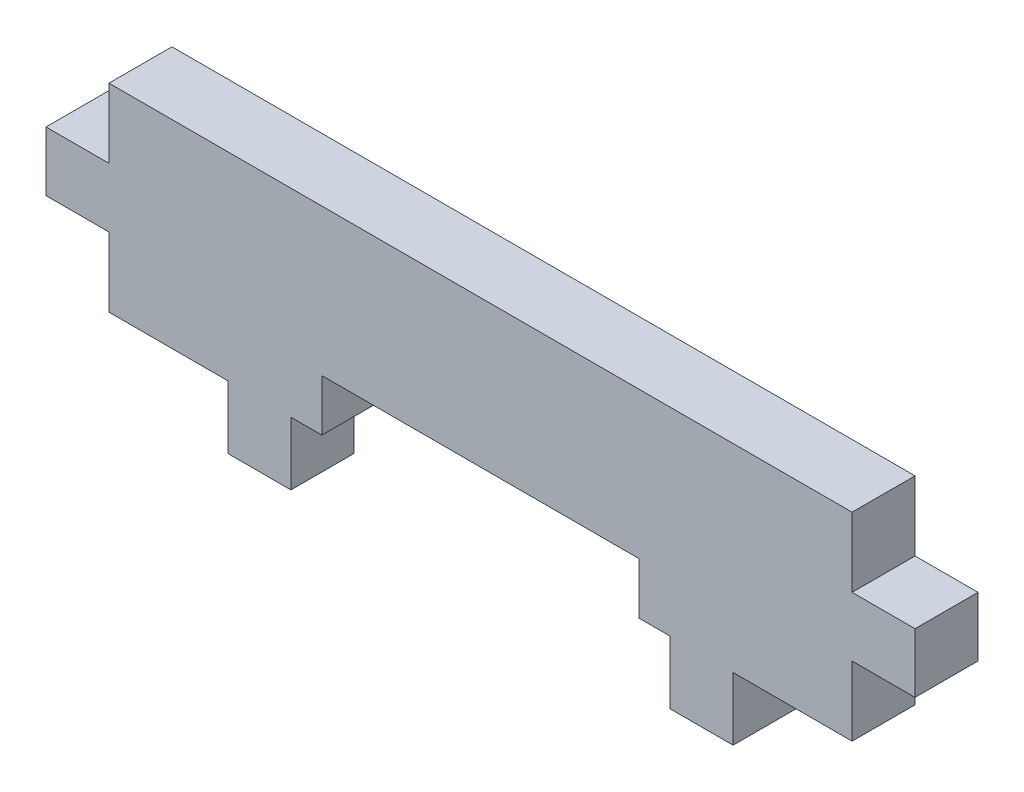
ISO-10303-21;
HEADER;
FILE_DESCRIPTION(('STEP AP214'),'2;1');
FILE_NAME('part.step','',(''),(''),'','','');
FILE_SCHEMA(('AUTOMOTIVE_DESIGN { 1 0 10303 214 1 1 1 1 }'));
ENDSEC;
DATA;
#1=APPLICATION_CONTEXT('core data for automotive mechanical design processes');
#2=APPLICATION_PROTOCOL_DEFINITION('international standard','automotive_design',2000,#1);
#3=PRODUCT_CONTEXT('',#1,'mechanical');
#4=PRODUCT('Part','Part','',(#3));
#5=PRODUCT_RELATED_PRODUCT_CATEGORY('part','',(#4));
#6=PRODUCT_DEFINITION_FORMATION('','',#4);
#7=PRODUCT_DEFINITION_CONTEXT('part definition',#1,'design');
#8=PRODUCT_DEFINITION('design','',#6,#7);
#9=PRODUCT_DEFINITION_SHAPE('','',#8);
#10=(LENGTH_UNIT() NAMED_UNIT(*) SI_UNIT(.MILLI.,.METRE.));
#11=(NAMED_UNIT(*) PLANE_ANGLE_UNIT() SI_UNIT($,.RADIAN.));
#12=(NAMED_UNIT(*) SI_UNIT($,.STERADIAN.) SOLID_ANGLE_UNIT());
#13=UNCERTAINTY_MEASURE_WITH_UNIT(LENGTH_MEASURE(1.E-05),#10,'distance_accuracy_value','');
#14=(GEOMETRIC_REPRESENTATION_CONTEXT(3) GLOBAL_UNCERTAINTY_ASSIGNED_CONTEXT((#13)) GLOBAL_UNIT_ASSIGNED_CONTEXT((#10,
#11,#12)) REPRESENTATION_CONTEXT('',''));
#15=CARTESIAN_POINT('',(0.,0.,0.));
#16=DIRECTION('',(0.,0.,1.));
#17=DIRECTION('',(1.,0.,0.));
#18=AXIS2_PLACEMENT_3D('',#15,#16,#17);
#19=CARTESIAN_POINT('',(9.56000000000001,-14.3526159152148,-3.175));
#20=DIRECTION('',(-1.,0.,0.));
#21=DIRECTION('',(0.,0.,1.));
#22=AXIS2_PLACEMENT_3D('',#19,#20,#21);
#23=PLANE('',#22);
#24=DIRECTION('',(0.,-1.,0.));
#25=VECTOR('',#24,1.);
#26=CARTESIAN_POINT('',(9.56000000000001,-14.3526159152148,0.));
#27=LINE('',#26,#25);
#28=CARTESIAN_POINT('',(9.56000000000001,-11.1776159152148,0.));
#29=VERTEX_POINT('',#28);
#30=CARTESIAN_POINT('',(9.56000000000001,-14.3526159152148,0.));
#31=VERTEX_POINT('',#30);
#32=EDGE_CURVE('E225',#29,#31,#27,.T.);
#33=ORIENTED_EDGE('',*,*,#32,.F.);
#34=DIRECTION('',(0.,0.,1.));
#35=VECTOR('',#34,1.);
#36=CARTESIAN_POINT('',(9.56000000000001,-11.1776159152148,-3.175));
#37=LINE('',#36,#35);
#38=CARTESIAN_POINT('',(9.56000000000001,-11.1776159152148,-3.175));
#39=VERTEX_POINT('',#38);
#40=EDGE_CURVE('E11',#39,#29,#37,.T.);
#41=ORIENTED_EDGE('',*,*,#40,.F.);
#42=DIRECTION('',(0.,-1.,0.));
#43=VECTOR('',#42,1.);
#44=CARTESIAN_POINT('',(9.56000000000001,-14.3526159152148,-3.175));
#45=LINE('',#44,#43);
#46=CARTESIAN_POINT('',(9.56000000000001,-14.3526159152148,-3.175));
#47=VERTEX_POINT('',#46);
#48=EDGE_CURVE('E293',#39,#47,#45,.T.);
#49=ORIENTED_EDGE('',*,*,#48,.T.);
#50=DIRECTION('',(0.,0.,1.));
#51=VECTOR('',#50,1.);
#52=CARTESIAN_POINT('',(9.56000000000001,-14.3526159152148,-3.175));
#53=LINE('',#52,#51);
#54=EDGE_CURVE('E35',#47,#31,#53,.T.);
#55=ORIENTED_EDGE('',*,*,#54,.T.);
#56=EDGE_LOOP('',(#33,#41,#49,#55));
#57=FACE_BOUND('',#56,.T.);
#58=ADVANCED_FACE('F32',(#57),#23,.T.);
#59=CARTESIAN_POINT('',(9.56000000000001,-11.1776159152148,-3.175));
#60=DIRECTION('',(0.,-1.,0.));
#61=DIRECTION('',(0.,0.,-1.));
#62=AXIS2_PLACEMENT_3D('',#59,#60,#61);
#63=PLANE('',#62);
#64=DIRECTION('',(1.,0.,0.));
#65=VECTOR('',#64,1.);
#66=CARTESIAN_POINT('',(9.56000000000001,-11.1776159152148,0.));
#67=LINE('',#66,#65);
#68=CARTESIAN_POINT('',(8.,-11.1776159152148,0.));
#69=VERTEX_POINT('',#68);
#70=EDGE_CURVE('E291',#69,#29,#67,.T.);
#71=ORIENTED_EDGE('',*,*,#70,.F.);
#72=DIRECTION('',(0.,0.,1.));
#73=VECTOR('',#72,1.);
#74=CARTESIAN_POINT('',(8.,-11.1776159152148,-3.175));
#75=LINE('',#74,#73);
#76=CARTESIAN_POINT('',(8.,-11.1776159152148,-3.175));
#77=VERTEX_POINT('',#76);
#78=EDGE_CURVE('E41',#77,#69,#75,.T.);
#79=ORIENTED_EDGE('',*,*,#78,.F.);
#80=DIRECTION('',(1.,0.,0.));
#81=VECTOR('',#80,1.);
#82=CARTESIAN_POINT('',(9.56000000000001,-11.1776159152148,-3.175));
#83=LINE('',#82,#81);
#84=EDGE_CURVE('E215',#77,#39,#83,.T.);
#85=ORIENTED_EDGE('',*,*,#84,.T.);
#86=ORIENTED_EDGE('',*,*,#40,.T.);
#87=EDGE_LOOP('',(#71,#79,#85,#86));
#88=FACE_BOUND('',#87,.T.);
#89=ADVANCED_FACE('F337',(#88),#63,.T.);
#90=CARTESIAN_POINT('',(8.,-8.57761591521484,-3.175));
#91=DIRECTION('',(-1.,0.,0.));
#92=DIRECTION('',(0.,0.,1.));
#93=AXIS2_PLACEMENT_3D('',#90,#91,#92);
#94=PLANE('',#93);
#95=DIRECTION('',(0.,-1.,0.));
#96=VECTOR('',#95,1.);
#97=CARTESIAN_POINT('',(8.,-8.57761591521484,0.));
#98=LINE('',#97,#96);
#99=CARTESIAN_POINT('',(8.,-8.57761591521484,0.));
#100=VERTEX_POINT('',#99);
#101=EDGE_CURVE('E202',#100,#69,#98,.T.);
#102=ORIENTED_EDGE('',*,*,#101,.F.);
#103=DIRECTION('',(0.,0.,1.));
#104=VECTOR('',#103,1.);
#105=CARTESIAN_POINT('',(8.,-8.57761591521484,-3.175));
#106=LINE('',#105,#104);
#107=CARTESIAN_POINT('',(8.,-8.57761591521484,-3.175));
#108=VERTEX_POINT('',#107);
#109=EDGE_CURVE('E197',#108,#100,#106,.T.);
#110=ORIENTED_EDGE('',*,*,#109,.F.);
#111=DIRECTION('',(0.,-1.,0.));
#112=VECTOR('',#111,1.);
#113=CARTESIAN_POINT('',(8.,-8.57761591521484,-3.175));
#114=LINE('',#113,#112);
#115=EDGE_CURVE('E200',#108,#77,#114,.T.);
#116=ORIENTED_EDGE('',*,*,#115,.T.);
#117=ORIENTED_EDGE('',*,*,#78,.T.);
#118=EDGE_LOOP('',(#102,#110,#116,#117));
#119=FACE_BOUND('',#118,.T.);
#120=ADVANCED_FACE('F199',(#119),#94,.T.);
#121=CARTESIAN_POINT('',(-8.,-8.57761591521484,-3.175));
#122=DIRECTION('',(0.,-1.,0.));
#123=DIRECTION('',(1.,0.,0.));
#124=AXIS2_PLACEMENT_3D('',#121,#122,#123);
#125=PLANE('',#124);
#126=DIRECTION('',(1.,0.,0.));
#127=VECTOR('',#126,1.);
#128=CARTESIAN_POINT('',(-8.,-8.57761591521484,0.));
#129=LINE('',#128,#127);
#130=CARTESIAN_POINT('',(-8.,-8.57761591521484,0.));
#131=VERTEX_POINT('',#130);
#132=EDGE_CURVE('E288',#131,#100,#129,.T.);
#133=ORIENTED_EDGE('',*,*,#132,.F.);
#134=DIRECTION('',(0.,0.,1.));
#135=VECTOR('',#134,1.);
#136=CARTESIAN_POINT('',(-8.,-8.57761591521484,-3.175));
#137=LINE('',#136,#135);
#138=CARTESIAN_POINT('',(-8.,-8.57761591521484,-3.175));
#139=VERTEX_POINT('',#138);
#140=EDGE_CURVE('E207',#139,#131,#137,.T.);
#141=ORIENTED_EDGE('',*,*,#140,.F.);
#142=DIRECTION('',(1.,0.,0.));
#143=VECTOR('',#142,1.);
#144=CARTESIAN_POINT('',(-8.,-8.57761591521484,-3.175));
#145=LINE('',#144,#143);
#146=EDGE_CURVE('E213',#139,#108,#145,.T.);
#147=ORIENTED_EDGE('',*,*,#146,.T.);
#148=ORIENTED_EDGE('',*,*,#109,.T.);
#149=EDGE_LOOP('',(#133,#141,#147,#148));
#150=FACE_BOUND('',#149,.T.);
#151=ADVANCED_FACE('F217',(#150),#125,.T.);
#152=CARTESIAN_POINT('',(-8.,-8.57761591521484,-3.175));
#153=DIRECTION('',(1.,0.,0.));
#154=DIRECTION('',(0.,0.,-1.));
#155=AXIS2_PLACEMENT_3D('',#152,#153,#154);
#156=PLANE('',#155);
#157=DIRECTION('',(0.,1.,0.));
#158=VECTOR('',#157,1.);
#159=CARTESIAN_POINT('',(-8.,-8.57761591521484,0.));
#160=LINE('',#159,#158);
#161=CARTESIAN_POINT('',(-8.,-11.1776159152148,0.));
#162=VERTEX_POINT('',#161);
#163=EDGE_CURVE('E285',#162,#131,#160,.T.);
#164=ORIENTED_EDGE('',*,*,#163,.F.);
#165=DIRECTION('',(0.,0.,1.));
#166=VECTOR('',#165,1.);
#167=CARTESIAN_POINT('',(-8.,-11.1776159152148,-3.175));
#168=LINE('',#167,#166);
#169=CARTESIAN_POINT('',(-8.,-11.1776159152148,-3.175));
#170=VERTEX_POINT('',#169);
#171=EDGE_CURVE('E297',#170,#162,#168,.T.);
#172=ORIENTED_EDGE('',*,*,#171,.F.);
#173=DIRECTION('',(0.,1.,0.));
#174=VECTOR('',#173,1.);
#175=CARTESIAN_POINT('',(-8.,-8.57761591521484,-3.175));
#176=LINE('',#175,#174);
#177=EDGE_CURVE('E218',#170,#139,#176,.T.);
#178=ORIENTED_EDGE('',*,*,#177,.T.);
#179=ORIENTED_EDGE('',*,*,#140,.T.);
#180=EDGE_LOOP('',(#164,#172,#178,#179));
#181=FACE_BOUND('',#180,.T.);
#182=ADVANCED_FACE('F350',(#181),#156,.T.);
#183=CARTESIAN_POINT('',(-9.56000000000001,-11.1776159152148,-3.175));
#184=DIRECTION('',(0.,-1.,0.));
#185=DIRECTION('',(0.,0.,-1.));
#186=AXIS2_PLACEMENT_3D('',#183,#184,#185);
#187=PLANE('',#186);
#188=DIRECTION('',(1.,0.,0.));
#189=VECTOR('',#188,1.);
#190=CARTESIAN_POINT('',(-9.56000000000001,-11.1776159152148,0.));
#191=LINE('',#190,#189);
#192=CARTESIAN_POINT('',(-9.56000000000001,-11.1776159152148,0.));
#193=VERTEX_POINT('',#192);
#194=EDGE_CURVE('E282',#193,#162,#191,.T.);
#195=ORIENTED_EDGE('',*,*,#194,.F.);
#196=DIRECTION('',(0.,0.,1.));
#197=VECTOR('',#196,1.);
#198=CARTESIAN_POINT('',(-9.56000000000001,-11.1776159152148,-3.175));
#199=LINE('',#198,#197);
#200=CARTESIAN_POINT('',(-9.56000000000001,-11.1776159152148,-3.175));
#201=VERTEX_POINT('',#200);
#202=EDGE_CURVE('E299',#201,#193,#199,.T.);
#203=ORIENTED_EDGE('',*,*,#202,.F.);
#204=DIRECTION('',(1.,0.,0.));
#205=VECTOR('',#204,1.);
#206=CARTESIAN_POINT('',(-9.56000000000001,-11.1776159152148,-3.175));
#207=LINE('',#206,#205);
#208=EDGE_CURVE('E220',#201,#170,#207,.T.);
#209=ORIENTED_EDGE('',*,*,#208,.T.);
#210=ORIENTED_EDGE('',*,*,#171,.T.);
#211=EDGE_LOOP('',(#195,#203,#209,#210));
#212=FACE_BOUND('',#211,.T.);
#213=ADVANCED_FACE('F353',(#212),#187,.T.);
#214=CARTESIAN_POINT('',(-9.56000000000001,-14.3526159152148,-3.175));
#215=DIRECTION('',(1.,0.,0.));
#216=DIRECTION('',(0.,0.,-1.));
#217=AXIS2_PLACEMENT_3D('',#214,#215,#216);
#218=PLANE('',#217);
#219=DIRECTION('',(0.,1.,0.));
#220=VECTOR('',#219,1.);
#221=CARTESIAN_POINT('',(-9.56000000000001,-14.3526159152148,0.));
#222=LINE('',#221,#220);
#223=CARTESIAN_POINT('',(-9.56000000000001,-14.3526159152148,0.));
#224=VERTEX_POINT('',#223);
#225=EDGE_CURVE('E279',#224,#193,#222,.T.);
#226=ORIENTED_EDGE('',*,*,#225,.F.);
#227=DIRECTION('',(0.,0.,1.));
#228=VECTOR('',#227,1.);
#229=CARTESIAN_POINT('',(-9.56000000000001,-14.3526159152148,-3.175));
#230=LINE('',#229,#228);
#231=CARTESIAN_POINT('',(-9.56000000000001,-14.3526159152148,-3.175));
#232=VERTEX_POINT('',#231);
#233=EDGE_CURVE('E301',#232,#224,#230,.T.);
#234=ORIENTED_EDGE('',*,*,#233,.F.);
#235=DIRECTION('',(0.,1.,0.));
#236=VECTOR('',#235,1.);
#237=CARTESIAN_POINT('',(-9.56000000000001,-14.3526159152148,-3.175));
#238=LINE('',#237,#236);
#239=EDGE_CURVE('E643',#232,#201,#238,.T.);
#240=ORIENTED_EDGE('',*,*,#239,.T.);
#241=ORIENTED_EDGE('',*,*,#202,.T.);
#242=EDGE_LOOP('',(#226,#234,#240,#241));
#243=FACE_BOUND('',#242,.T.);
#244=ADVANCED_FACE('F357',(#243),#218,.T.);
#245=CARTESIAN_POINT('',(-12.735,-14.3526159152148,-3.175));
#246=DIRECTION('',(0.,-1.,0.));
#247=DIRECTION('',(0.,0.,-1.));
#248=AXIS2_PLACEMENT_3D('',#245,#246,#247);
#249=PLANE('',#248);
#250=DIRECTION('',(1.,0.,0.));
#251=VECTOR('',#250,1.);
#252=CARTESIAN_POINT('',(-12.735,-14.3526159152148,0.));
#253=LINE('',#252,#251);
#254=CARTESIAN_POINT('',(-12.735,-14.3526159152148,0.));
#255=VERTEX_POINT('',#254);
#256=EDGE_CURVE('E276',#255,#224,#253,.T.);
#257=ORIENTED_EDGE('',*,*,#256,.F.);
#258=DIRECTION('',(0.,0.,1.));
#259=VECTOR('',#258,1.);
#260=CARTESIAN_POINT('',(-12.735,-14.3526159152148,-3.175));
#261=LINE('',#260,#259);
#262=CARTESIAN_POINT('',(-12.735,-14.3526159152148,-3.175));
#263=VERTEX_POINT('',#262);
#264=EDGE_CURVE('E303',#263,#255,#261,.T.);
#265=ORIENTED_EDGE('',*,*,#264,.F.);
#266=DIRECTION('',(1.,0.,0.));
#267=VECTOR('',#266,1.);
#268=CARTESIAN_POINT('',(-12.735,-14.3526159152148,-3.175));
#269=LINE('',#268,#267);
#270=EDGE_CURVE('E647',#263,#232,#269,.T.);
#271=ORIENTED_EDGE('',*,*,#270,.T.);
#272=ORIENTED_EDGE('',*,*,#233,.T.);
#273=EDGE_LOOP('',(#257,#265,#271,#272));
#274=FACE_BOUND('',#273,.T.);
#275=ADVANCED_FACE('F361',(#274),#249,.T.);
#276=CARTESIAN_POINT('',(-12.735,-11.1776159152148,-3.175));
#277=DIRECTION('',(-1.,0.,0.));
#278=DIRECTION('',(0.,0.,1.));
#279=AXIS2_PLACEMENT_3D('',#276,#277,#278);
#280=PLANE('',#279);
#281=DIRECTION('',(0.,-1.,0.));
#282=VECTOR('',#281,1.);
#283=CARTESIAN_POINT('',(-12.735,-11.1776159152148,0.));
#284=LINE('',#283,#282);
#285=CARTESIAN_POINT('',(-12.735,-11.1776159152148,0.));
#286=VERTEX_POINT('',#285);
#287=EDGE_CURVE('E273',#286,#255,#284,.T.);
#288=ORIENTED_EDGE('',*,*,#287,.F.);
#289=DIRECTION('',(0.,0.,1.));
#290=VECTOR('',#289,1.);
#291=CARTESIAN_POINT('',(-12.735,-11.1776159152148,-3.175));
#292=LINE('',#291,#290);
#293=CARTESIAN_POINT('',(-12.735,-11.1776159152148,-3.175));
#294=VERTEX_POINT('',#293);
#295=EDGE_CURVE('E305',#294,#286,#292,.T.);
#296=ORIENTED_EDGE('',*,*,#295,.F.);
#297=DIRECTION('',(0.,-1.,0.));
#298=VECTOR('',#297,1.);
#299=CARTESIAN_POINT('',(-12.735,-11.1776159152148,-3.175));
#300=LINE('',#299,#298);
#301=EDGE_CURVE('E636',#294,#263,#300,.T.);
#302=ORIENTED_EDGE('',*,*,#301,.T.);
#303=ORIENTED_EDGE('',*,*,#264,.T.);
#304=EDGE_LOOP('',(#288,#296,#302,#303));
#305=FACE_BOUND('',#304,.T.);
#306=ADVANCED_FACE('F365',(#305),#280,.T.);
#307=CARTESIAN_POINT('',(-12.735,-11.1776159152148,-3.175));
#308=DIRECTION('',(0.,-1.,0.));
#309=DIRECTION('',(0.,0.,-1.));
#310=AXIS2_PLACEMENT_3D('',#307,#308,#309);
#311=PLANE('',#310);
#312=DIRECTION('',(1.,0.,0.));
#313=VECTOR('',#312,1.);
#314=CARTESIAN_POINT('',(-12.735,-11.1776159152148,0.));
#315=LINE('',#314,#313);
#316=CARTESIAN_POINT('',(-18.735,-11.1776159152148,0.));
#317=VERTEX_POINT('',#316);
#318=EDGE_CURVE('E270',#317,#286,#315,.T.);
#319=ORIENTED_EDGE('',*,*,#318,.F.);
#320=DIRECTION('',(0.,0.,1.));
#321=VECTOR('',#320,1.);
#322=CARTESIAN_POINT('',(-18.735,-11.1776159152148,-3.175));
#323=LINE('',#322,#321);
#324=CARTESIAN_POINT('',(-18.735,-11.1776159152148,-3.175));
#325=VERTEX_POINT('',#324);
#326=EDGE_CURVE('E307',#325,#317,#323,.T.);
#327=ORIENTED_EDGE('',*,*,#326,.F.);
#328=DIRECTION('',(1.,0.,0.));
#329=VECTOR('',#328,1.);
#330=CARTESIAN_POINT('',(-12.735,-11.1776159152148,-3.175));
#331=LINE('',#330,#329);
#332=EDGE_CURVE('E632',#325,#294,#331,.T.);
#333=ORIENTED_EDGE('',*,*,#332,.T.);
#334=ORIENTED_EDGE('',*,*,#295,.T.);
#335=EDGE_LOOP('',(#319,#327,#333,#334));
#336=FACE_BOUND('',#335,.T.);
#337=ADVANCED_FACE('F369',(#336),#311,.T.);
#338=CARTESIAN_POINT('',(-18.735,-11.1776159152148,-3.175));
#339=DIRECTION('',(-1.,0.,0.));
#340=DIRECTION('',(0.,0.,1.));
#341=AXIS2_PLACEMENT_3D('',#338,#339,#340);
#342=PLANE('',#341);
#343=DIRECTION('',(0.,-1.,0.));
#344=VECTOR('',#343,1.);
#345=CARTESIAN_POINT('',(-18.735,-11.1776159152148,0.));
#346=LINE('',#345,#344);
#347=CARTESIAN_POINT('',(-18.735,-7.67761591521484,0.));
#348=VERTEX_POINT('',#347);
#349=EDGE_CURVE('E267',#348,#317,#346,.T.);
#350=ORIENTED_EDGE('',*,*,#349,.F.);
#351=DIRECTION('',(0.,0.,1.));
#352=VECTOR('',#351,1.);
#353=CARTESIAN_POINT('',(-18.735,-7.67761591521484,-3.175));
#354=LINE('',#353,#352);
#355=CARTESIAN_POINT('',(-18.735,-7.67761591521484,-3.175));
#356=VERTEX_POINT('',#355);
#357=EDGE_CURVE('E309',#356,#348,#354,.T.);
#358=ORIENTED_EDGE('',*,*,#357,.F.);
#359=DIRECTION('',(0.,-1.,0.));
#360=VECTOR('',#359,1.);
#361=CARTESIAN_POINT('',(-18.735,-11.1776159152148,-3.175));
#362=LINE('',#361,#360);
#363=EDGE_CURVE('E653',#356,#325,#362,.T.);
#364=ORIENTED_EDGE('',*,*,#363,.T.);
#365=ORIENTED_EDGE('',*,*,#326,.T.);
#366=EDGE_LOOP('',(#350,#358,#364,#365));
#367=FACE_BOUND('',#366,.T.);
#368=ADVANCED_FACE('F373',(#367),#342,.T.);
#369=CARTESIAN_POINT('',(-18.735,-7.67761591521484,-3.175));
#370=DIRECTION('',(0.,-1.,0.));
#371=DIRECTION('',(1.,0.,0.));
#372=AXIS2_PLACEMENT_3D('',#369,#370,#371);
#373=PLANE('',#372);
#374=DIRECTION('',(1.,0.,0.));
#375=VECTOR('',#374,1.);
#376=CARTESIAN_POINT('',(-18.735,-7.67761591521484,0.));
#377=LINE('',#376,#375);
#378=CARTESIAN_POINT('',(-21.91,-7.67761591521484,0.));
#379=VERTEX_POINT('',#378);
#380=EDGE_CURVE('E264',#379,#348,#377,.T.);
#381=ORIENTED_EDGE('',*,*,#380,.F.);
#382=DIRECTION('',(0.,0.,1.));
#383=VECTOR('',#382,1.);
#384=CARTESIAN_POINT('',(-21.91,-7.67761591521484,-3.175));
#385=LINE('',#384,#383);
#386=CARTESIAN_POINT('',(-21.91,-7.67761591521484,-3.175));
#387=VERTEX_POINT('',#386);
#388=EDGE_CURVE('E311',#387,#379,#385,.T.);
#389=ORIENTED_EDGE('',*,*,#388,.F.);
#390=DIRECTION('',(1.,0.,0.));
#391=VECTOR('',#390,1.);
#392=CARTESIAN_POINT('',(-18.735,-7.67761591521484,-3.175));
#393=LINE('',#392,#391);
#394=EDGE_CURVE('E625',#387,#356,#393,.T.);
#395=ORIENTED_EDGE('',*,*,#394,.T.);
#396=ORIENTED_EDGE('',*,*,#357,.T.);
#397=EDGE_LOOP('',(#381,#389,#395,#396));
#398=FACE_BOUND('',#397,.T.);
#399=ADVANCED_FACE('F377',(#398),#373,.T.);
#400=CARTESIAN_POINT('',(-21.91,-4.67761591521484,-3.175));
#401=DIRECTION('',(-1.,0.,0.));
#402=DIRECTION('',(0.,0.,1.));
#403=AXIS2_PLACEMENT_3D('',#400,#401,#402);
#404=PLANE('',#403);
#405=DIRECTION('',(0.,-1.,0.));
#406=VECTOR('',#405,1.);
#407=CARTESIAN_POINT('',(-21.91,-4.67761591521484,0.));
#408=LINE('',#407,#406);
#409=CARTESIAN_POINT('',(-21.91,-4.67761591521484,0.));
#410=VERTEX_POINT('',#409);
#411=EDGE_CURVE('E261',#410,#379,#408,.T.);
#412=ORIENTED_EDGE('',*,*,#411,.F.);
#413=DIRECTION('',(0.,0.,1.));
#414=VECTOR('',#413,1.);
#415=CARTESIAN_POINT('',(-21.91,-4.67761591521484,-3.175));
#416=LINE('',#415,#414);
#417=CARTESIAN_POINT('',(-21.91,-4.67761591521484,-3.175));
#418=VERTEX_POINT('',#417);
#419=EDGE_CURVE('E313',#418,#410,#416,.T.);
#420=ORIENTED_EDGE('',*,*,#419,.F.);
#421=DIRECTION('',(0.,-1.,0.));
#422=VECTOR('',#421,1.);
#423=CARTESIAN_POINT('',(-21.91,-4.67761591521484,-3.175));
#424=LINE('',#423,#422);
#425=EDGE_CURVE('E621',#418,#387,#424,.T.);
#426=ORIENTED_EDGE('',*,*,#425,.T.);
#427=ORIENTED_EDGE('',*,*,#388,.T.);
#428=EDGE_LOOP('',(#412,#420,#426,#427));
#429=FACE_BOUND('',#428,.T.);
#430=ADVANCED_FACE('F381',(#429),#404,.T.);
#431=CARTESIAN_POINT('',(-21.91,-4.67761591521484,-3.175));
#432=DIRECTION('',(0.,1.,0.));
#433=DIRECTION('',(-1.,0.,0.));
#434=AXIS2_PLACEMENT_3D('',#431,#432,#433);
#435=PLANE('',#434);
#436=DIRECTION('',(-1.,0.,0.));
#437=VECTOR('',#436,1.);
#438=CARTESIAN_POINT('',(-21.91,-4.67761591521484,0.));
#439=LINE('',#438,#437);
#440=CARTESIAN_POINT('',(-18.735,-4.67761591521484,0.));
#441=VERTEX_POINT('',#440);
#442=EDGE_CURVE('E258',#441,#410,#439,.T.);
#443=ORIENTED_EDGE('',*,*,#442,.F.);
#444=DIRECTION('',(0.,0.,1.));
#445=VECTOR('',#444,1.);
#446=CARTESIAN_POINT('',(-18.735,-4.67761591521484,-3.175));
#447=LINE('',#446,#445);
#448=CARTESIAN_POINT('',(-18.735,-4.67761591521484,-3.175));
#449=VERTEX_POINT('',#448);
#450=EDGE_CURVE('E315',#449,#441,#447,.T.);
#451=ORIENTED_EDGE('',*,*,#450,.F.);
#452=DIRECTION('',(-1.,0.,0.));
#453=VECTOR('',#452,1.);
#454=CARTESIAN_POINT('',(-21.91,-4.67761591521484,-3.175));
#455=LINE('',#454,#453);
#456=EDGE_CURVE('E657',#449,#418,#455,.T.);
#457=ORIENTED_EDGE('',*,*,#456,.T.);
#458=ORIENTED_EDGE('',*,*,#419,.T.);
#459=EDGE_LOOP('',(#443,#451,#457,#458));
#460=FACE_BOUND('',#459,.T.);
#461=ADVANCED_FACE('F385',(#460),#435,.T.);
#462=CARTESIAN_POINT('',(-18.735,-4.67761591521484,-3.175));
#463=DIRECTION('',(-1.,0.,0.));
#464=DIRECTION('',(0.,0.,1.));
#465=AXIS2_PLACEMENT_3D('',#462,#463,#464);
#466=PLANE('',#465);
#467=DIRECTION('',(0.,-1.,0.));
#468=VECTOR('',#467,1.);
#469=CARTESIAN_POINT('',(-18.735,-4.67761591521484,0.));
#470=LINE('',#469,#468);
#471=CARTESIAN_POINT('',(-18.735,-1.17761591521484,0.));
#472=VERTEX_POINT('',#471);
#473=EDGE_CURVE('E255',#472,#441,#470,.T.);
#474=ORIENTED_EDGE('',*,*,#473,.F.);
#475=DIRECTION('',(0.,0.,1.));
#476=VECTOR('',#475,1.);
#477=CARTESIAN_POINT('',(-18.735,-1.17761591521484,-3.175));
#478=LINE('',#477,#476);
#479=CARTESIAN_POINT('',(-18.735,-1.17761591521484,-3.175));
#480=VERTEX_POINT('',#479);
#481=EDGE_CURVE('E317',#480,#472,#478,.T.);
#482=ORIENTED_EDGE('',*,*,#481,.F.);
#483=DIRECTION('',(0.,-1.,0.));
#484=VECTOR('',#483,1.);
#485=CARTESIAN_POINT('',(-18.735,-4.67761591521484,-3.175));
#486=LINE('',#485,#484);
#487=EDGE_CURVE('E614',#480,#449,#486,.T.);
#488=ORIENTED_EDGE('',*,*,#487,.T.);
#489=ORIENTED_EDGE('',*,*,#450,.T.);
#490=EDGE_LOOP('',(#474,#482,#488,#489));
#491=FACE_BOUND('',#490,.T.);
#492=ADVANCED_FACE('F389',(#491),#466,.T.);
#493=CARTESIAN_POINT('',(18.735,-1.17761591521484,-3.175));
#494=DIRECTION('',(0.,1.,0.));
#495=DIRECTION('',(0.,0.,1.));
#496=AXIS2_PLACEMENT_3D('',#493,#494,#495);
#497=PLANE('',#496);
#498=DIRECTION('',(-1.,0.,0.));
#499=VECTOR('',#498,1.);
#500=CARTESIAN_POINT('',(18.735,-1.17761591521484,0.));
#501=LINE('',#500,#499);
#502=CARTESIAN_POINT('',(18.735,-1.17761591521484,0.));
#503=VERTEX_POINT('',#502);
#504=EDGE_CURVE('E252',#503,#472,#501,.T.);
#505=ORIENTED_EDGE('',*,*,#504,.F.);
#506=DIRECTION('',(0.,0.,1.));
#507=VECTOR('',#506,1.);
#508=CARTESIAN_POINT('',(18.735,-1.17761591521484,-3.175));
#509=LINE('',#508,#507);
#510=CARTESIAN_POINT('',(18.735,-1.17761591521484,-3.175));
#511=VERTEX_POINT('',#510);
#512=EDGE_CURVE('E319',#511,#503,#509,.T.);
#513=ORIENTED_EDGE('',*,*,#512,.F.);
#514=DIRECTION('',(-1.,0.,0.));
#515=VECTOR('',#514,1.);
#516=CARTESIAN_POINT('',(18.735,-1.17761591521484,-3.175));
#517=LINE('',#516,#515);
#518=EDGE_CURVE('E610',#511,#480,#517,.T.);
#519=ORIENTED_EDGE('',*,*,#518,.T.);
#520=ORIENTED_EDGE('',*,*,#481,.T.);
#521=EDGE_LOOP('',(#505,#513,#519,#520));
#522=FACE_BOUND('',#521,.T.);
#523=ADVANCED_FACE('F393',(#522),#497,.T.);
#524=CARTESIAN_POINT('',(18.735,-4.67761591521484,-3.175));
#525=DIRECTION('',(1.,0.,0.));
#526=DIRECTION('',(0.,0.,-1.));
#527=AXIS2_PLACEMENT_3D('',#524,#525,#526);
#528=PLANE('',#527);
#529=DIRECTION('',(0.,1.,0.));
#530=VECTOR('',#529,1.);
#531=CARTESIAN_POINT('',(18.735,-4.67761591521484,0.));
#532=LINE('',#531,#530);
#533=CARTESIAN_POINT('',(18.735,-4.67761591521484,0.));
#534=VERTEX_POINT('',#533);
#535=EDGE_CURVE('E249',#534,#503,#532,.T.);
#536=ORIENTED_EDGE('',*,*,#535,.F.);
#537=DIRECTION('',(0.,0.,1.));
#538=VECTOR('',#537,1.);
#539=CARTESIAN_POINT('',(18.735,-4.67761591521484,-3.175));
#540=LINE('',#539,#538);
#541=CARTESIAN_POINT('',(18.735,-4.67761591521484,-3.175));
#542=VERTEX_POINT('',#541);
#543=EDGE_CURVE('E321',#542,#534,#540,.T.);
#544=ORIENTED_EDGE('',*,*,#543,.F.);
#545=DIRECTION('',(0.,1.,0.));
#546=VECTOR('',#545,1.);
#547=CARTESIAN_POINT('',(18.735,-4.67761591521484,-3.175));
#548=LINE('',#547,#546);
#549=EDGE_CURVE('E661',#542,#511,#548,.T.);
#550=ORIENTED_EDGE('',*,*,#549,.T.);
#551=ORIENTED_EDGE('',*,*,#512,.T.);
#552=EDGE_LOOP('',(#536,#544,#550,#551));
#553=FACE_BOUND('',#552,.T.);
#554=ADVANCED_FACE('F397',(#553),#528,.T.);
#555=CARTESIAN_POINT('',(21.91,-4.67761591521484,-3.175));
#556=DIRECTION('',(0.,1.,0.));
#557=DIRECTION('',(-1.,0.,0.));
#558=AXIS2_PLACEMENT_3D('',#555,#556,#557);
#559=PLANE('',#558);
#560=DIRECTION('',(-1.,0.,0.));
#561=VECTOR('',#560,1.);
#562=CARTESIAN_POINT('',(21.91,-4.67761591521484,0.));
#563=LINE('',#562,#561);
#564=CARTESIAN_POINT('',(21.91,-4.67761591521484,0.));
#565=VERTEX_POINT('',#564);
#566=EDGE_CURVE('E246',#565,#534,#563,.T.);
#567=ORIENTED_EDGE('',*,*,#566,.F.);
#568=DIRECTION('',(0.,0.,1.));
#569=VECTOR('',#568,1.);
#570=CARTESIAN_POINT('',(21.91,-4.67761591521484,-3.175));
#571=LINE('',#570,#569);
#572=CARTESIAN_POINT('',(21.91,-4.67761591521484,-3.175));
#573=VERTEX_POINT('',#572);
#574=EDGE_CURVE('E323',#573,#565,#571,.T.);
#575=ORIENTED_EDGE('',*,*,#574,.F.);
#576=DIRECTION('',(-1.,0.,0.));
#577=VECTOR('',#576,1.);
#578=CARTESIAN_POINT('',(21.91,-4.67761591521484,-3.175));
#579=LINE('',#578,#577);
#580=EDGE_CURVE('E603',#573,#542,#579,.T.);
#581=ORIENTED_EDGE('',*,*,#580,.T.);
#582=ORIENTED_EDGE('',*,*,#543,.T.);
#583=EDGE_LOOP('',(#567,#575,#581,#582));
#584=FACE_BOUND('',#583,.T.);
#585=ADVANCED_FACE('F401',(#584),#559,.T.);
#586=CARTESIAN_POINT('',(21.91,-4.67761591521484,-3.175));
#587=DIRECTION('',(1.,0.,0.));
#588=DIRECTION('',(0.,0.,-1.));
#589=AXIS2_PLACEMENT_3D('',#586,#587,#588);
#590=PLANE('',#589);
#591=DIRECTION('',(0.,1.,0.));
#592=VECTOR('',#591,1.);
#593=CARTESIAN_POINT('',(21.91,-4.67761591521484,0.));
#594=LINE('',#593,#592);
#595=CARTESIAN_POINT('',(21.91,-7.67761591521484,0.));
#596=VERTEX_POINT('',#595);
#597=EDGE_CURVE('E243',#596,#565,#594,.T.);
#598=ORIENTED_EDGE('',*,*,#597,.F.);
#599=DIRECTION('',(0.,0.,1.));
#600=VECTOR('',#599,1.);
#601=CARTESIAN_POINT('',(21.91,-7.67761591521484,-3.175));
#602=LINE('',#601,#600);
#603=CARTESIAN_POINT('',(21.91,-7.67761591521484,-3.175));
#604=VERTEX_POINT('',#603);
#605=EDGE_CURVE('E325',#604,#596,#602,.T.);
#606=ORIENTED_EDGE('',*,*,#605,.F.);
#607=DIRECTION('',(0.,1.,0.));
#608=VECTOR('',#607,1.);
#609=CARTESIAN_POINT('',(21.91,-4.67761591521484,-3.175));
#610=LINE('',#609,#608);
#611=EDGE_CURVE('E599',#604,#573,#610,.T.);
#612=ORIENTED_EDGE('',*,*,#611,.T.);
#613=ORIENTED_EDGE('',*,*,#574,.T.);
#614=EDGE_LOOP('',(#598,#606,#612,#613));
#615=FACE_BOUND('',#614,.T.);
#616=ADVANCED_FACE('F405',(#615),#590,.T.);
#617=CARTESIAN_POINT('',(18.735,-7.67761591521484,-3.175));
#618=DIRECTION('',(0.,-1.,0.));
#619=DIRECTION('',(1.,0.,0.));
#620=AXIS2_PLACEMENT_3D('',#617,#618,#619);
#621=PLANE('',#620);
#622=DIRECTION('',(1.,0.,0.));
#623=VECTOR('',#622,1.);
#624=CARTESIAN_POINT('',(18.735,-7.67761591521484,0.));
#625=LINE('',#624,#623);
#626=CARTESIAN_POINT('',(18.735,-7.67761591521484,0.));
#627=VERTEX_POINT('',#626);
#628=EDGE_CURVE('E240',#627,#596,#625,.T.);
#629=ORIENTED_EDGE('',*,*,#628,.F.);
#630=DIRECTION('',(0.,0.,1.));
#631=VECTOR('',#630,1.);
#632=CARTESIAN_POINT('',(18.735,-7.67761591521484,-3.175));
#633=LINE('',#632,#631);
#634=CARTESIAN_POINT('',(18.735,-7.67761591521484,-3.175));
#635=VERTEX_POINT('',#634);
#636=EDGE_CURVE('E327',#635,#627,#633,.T.);
#637=ORIENTED_EDGE('',*,*,#636,.F.);
#638=DIRECTION('',(1.,0.,0.));
#639=VECTOR('',#638,1.);
#640=CARTESIAN_POINT('',(18.735,-7.67761591521484,-3.175));
#641=LINE('',#640,#639);
#642=EDGE_CURVE('E665',#635,#604,#641,.T.);
#643=ORIENTED_EDGE('',*,*,#642,.T.);
#644=ORIENTED_EDGE('',*,*,#605,.T.);
#645=EDGE_LOOP('',(#629,#637,#643,#644));
#646=FACE_BOUND('',#645,.T.);
#647=ADVANCED_FACE('F409',(#646),#621,.T.);
#648=CARTESIAN_POINT('',(18.735,-11.1776159152148,-3.175));
#649=DIRECTION('',(1.,0.,0.));
#650=DIRECTION('',(0.,0.,-1.));
#651=AXIS2_PLACEMENT_3D('',#648,#649,#650);
#652=PLANE('',#651);
#653=DIRECTION('',(0.,1.,0.));
#654=VECTOR('',#653,1.);
#655=CARTESIAN_POINT('',(18.735,-11.1776159152148,0.));
#656=LINE('',#655,#654);
#657=CARTESIAN_POINT('',(18.735,-11.1776159152148,0.));
#658=VERTEX_POINT('',#657);
#659=EDGE_CURVE('E237',#658,#627,#656,.T.);
#660=ORIENTED_EDGE('',*,*,#659,.F.);
#661=DIRECTION('',(0.,0.,1.));
#662=VECTOR('',#661,1.);
#663=CARTESIAN_POINT('',(18.735,-11.1776159152148,-3.175));
#664=LINE('',#663,#662);
#665=CARTESIAN_POINT('',(18.735,-11.1776159152148,-3.175));
#666=VERTEX_POINT('',#665);
#667=EDGE_CURVE('E329',#666,#658,#664,.T.);
#668=ORIENTED_EDGE('',*,*,#667,.F.);
#669=DIRECTION('',(0.,1.,0.));
#670=VECTOR('',#669,1.);
#671=CARTESIAN_POINT('',(18.735,-11.1776159152148,-3.175));
#672=LINE('',#671,#670);
#673=EDGE_CURVE('E592',#666,#635,#672,.T.);
#674=ORIENTED_EDGE('',*,*,#673,.T.);
#675=ORIENTED_EDGE('',*,*,#636,.T.);
#676=EDGE_LOOP('',(#660,#668,#674,#675));
#677=FACE_BOUND('',#676,.T.);
#678=ADVANCED_FACE('F413',(#677),#652,.T.);
#679=CARTESIAN_POINT('',(12.735,-11.1776159152148,-3.175));
#680=DIRECTION('',(0.,-1.,0.));
#681=DIRECTION('',(0.,0.,-1.));
#682=AXIS2_PLACEMENT_3D('',#679,#680,#681);
#683=PLANE('',#682);
#684=DIRECTION('',(1.,0.,0.));
#685=VECTOR('',#684,1.);
#686=CARTESIAN_POINT('',(12.735,-11.1776159152148,0.));
#687=LINE('',#686,#685);
#688=CARTESIAN_POINT('',(12.735,-11.1776159152148,0.));
#689=VERTEX_POINT('',#688);
#690=EDGE_CURVE('E234',#689,#658,#687,.T.);
#691=ORIENTED_EDGE('',*,*,#690,.F.);
#692=DIRECTION('',(0.,0.,1.));
#693=VECTOR('',#692,1.);
#694=CARTESIAN_POINT('',(12.735,-11.1776159152148,-3.175));
#695=LINE('',#694,#693);
#696=CARTESIAN_POINT('',(12.735,-11.1776159152148,-3.175));
#697=VERTEX_POINT('',#696);
#698=EDGE_CURVE('E331',#697,#689,#695,.T.);
#699=ORIENTED_EDGE('',*,*,#698,.F.);
#700=DIRECTION('',(1.,0.,0.));
#701=VECTOR('',#700,1.);
#702=CARTESIAN_POINT('',(12.735,-11.1776159152148,-3.175));
#703=LINE('',#702,#701);
#704=EDGE_CURVE('E588',#697,#666,#703,.T.);
#705=ORIENTED_EDGE('',*,*,#704,.T.);
#706=ORIENTED_EDGE('',*,*,#667,.T.);
#707=EDGE_LOOP('',(#691,#699,#705,#706));
#708=FACE_BOUND('',#707,.T.);
#709=ADVANCED_FACE('F417',(#708),#683,.T.);
#710=CARTESIAN_POINT('',(12.735,-11.1776159152148,-3.175));
#711=DIRECTION('',(1.,0.,0.));
#712=DIRECTION('',(0.,0.,-1.));
#713=AXIS2_PLACEMENT_3D('',#710,#711,#712);
#714=PLANE('',#713);
#715=DIRECTION('',(0.,1.,0.));
#716=VECTOR('',#715,1.);
#717=CARTESIAN_POINT('',(12.735,-11.1776159152148,0.));
#718=LINE('',#717,#716);
#719=CARTESIAN_POINT('',(12.735,-14.3526159152148,0.));
#720=VERTEX_POINT('',#719);
#721=EDGE_CURVE('E231',#720,#689,#718,.T.);
#722=ORIENTED_EDGE('',*,*,#721,.F.);
#723=DIRECTION('',(0.,0.,1.));
#724=VECTOR('',#723,1.);
#725=CARTESIAN_POINT('',(12.735,-14.3526159152148,-3.175));
#726=LINE('',#725,#724);
#727=CARTESIAN_POINT('',(12.735,-14.3526159152148,-3.175));
#728=VERTEX_POINT('',#727);
#729=EDGE_CURVE('E332',#728,#720,#726,.T.);
#730=ORIENTED_EDGE('',*,*,#729,.F.);
#731=DIRECTION('',(0.,1.,0.));
#732=VECTOR('',#731,1.);
#733=CARTESIAN_POINT('',(12.735,-11.1776159152148,-3.175));
#734=LINE('',#733,#732);
#735=EDGE_CURVE('E669',#728,#697,#734,.T.);
#736=ORIENTED_EDGE('',*,*,#735,.T.);
#737=ORIENTED_EDGE('',*,*,#698,.T.);
#738=EDGE_LOOP('',(#722,#730,#736,#737));
#739=FACE_BOUND('',#738,.T.);
#740=ADVANCED_FACE('F421',(#739),#714,.T.);
#741=CARTESIAN_POINT('',(12.735,-14.3526159152148,-3.175));
#742=DIRECTION('',(0.,-1.,0.));
#743=DIRECTION('',(0.,0.,-1.));
#744=AXIS2_PLACEMENT_3D('',#741,#742,#743);
#745=PLANE('',#744);
#746=DIRECTION('',(1.,0.,0.));
#747=VECTOR('',#746,1.);
#748=CARTESIAN_POINT('',(12.735,-14.3526159152148,0.));
#749=LINE('',#748,#747);
#750=EDGE_CURVE('E228',#31,#720,#749,.T.);
#751=ORIENTED_EDGE('',*,*,#750,.F.);
#752=ORIENTED_EDGE('',*,*,#54,.F.);
#753=DIRECTION('',(1.,0.,0.));
#754=VECTOR('',#753,1.);
#755=CARTESIAN_POINT('',(12.735,-14.3526159152148,-3.175));
#756=LINE('',#755,#754);
#757=EDGE_CURVE('E671',#47,#728,#756,.T.);
#758=ORIENTED_EDGE('',*,*,#757,.T.);
#759=ORIENTED_EDGE('',*,*,#729,.T.);
#760=EDGE_LOOP('',(#751,#752,#758,#759));
#761=FACE_BOUND('',#760,.T.);
#762=ADVANCED_FACE('F334',(#761),#745,.T.);
#763=CARTESIAN_POINT('',(0.,0.,-3.175));
#764=DIRECTION('',(0.,0.,1.));
#765=DIRECTION('',(1.,0.,0.));
#766=AXIS2_PLACEMENT_3D('',#763,#764,#765);
#767=PLANE('',#766);
#768=ORIENTED_EDGE('',*,*,#48,.F.);
#769=ORIENTED_EDGE('',*,*,#84,.F.);
#770=ORIENTED_EDGE('',*,*,#115,.F.);
#771=ORIENTED_EDGE('',*,*,#146,.F.);
#772=ORIENTED_EDGE('',*,*,#177,.F.);
#773=ORIENTED_EDGE('',*,*,#208,.F.);
#774=ORIENTED_EDGE('',*,*,#239,.F.);
#775=ORIENTED_EDGE('',*,*,#270,.F.);
#776=ORIENTED_EDGE('',*,*,#301,.F.);
#777=ORIENTED_EDGE('',*,*,#332,.F.);
#778=ORIENTED_EDGE('',*,*,#363,.F.);
#779=ORIENTED_EDGE('',*,*,#394,.F.);
#780=ORIENTED_EDGE('',*,*,#425,.F.);
#781=ORIENTED_EDGE('',*,*,#456,.F.);
#782=ORIENTED_EDGE('',*,*,#487,.F.);
#783=ORIENTED_EDGE('',*,*,#518,.F.);
#784=ORIENTED_EDGE('',*,*,#549,.F.);
#785=ORIENTED_EDGE('',*,*,#580,.F.);
#786=ORIENTED_EDGE('',*,*,#611,.F.);
#787=ORIENTED_EDGE('',*,*,#642,.F.);
#788=ORIENTED_EDGE('',*,*,#673,.F.);
#789=ORIENTED_EDGE('',*,*,#704,.F.);
#790=ORIENTED_EDGE('',*,*,#735,.F.);
#791=ORIENTED_EDGE('',*,*,#757,.F.);
#792=EDGE_LOOP('',(#768,#769,#770,#771,#772,#773,#774,#775,#776,#777,#778,#779,#780,#781,#782,
#783,#784,#785,#786,#787,#788,#789,#790,#791));
#793=FACE_BOUND('',#792,.T.);
#794=ADVANCED_FACE('F211',(#793),#767,.F.);
#795=CARTESIAN_POINT('',(0.,0.,0.));
#796=DIRECTION('',(0.,0.,1.));
#797=DIRECTION('',(1.,0.,0.));
#798=AXIS2_PLACEMENT_3D('',#795,#796,#797);
#799=PLANE('',#798);
#800=ORIENTED_EDGE('',*,*,#32,.T.);
#801=ORIENTED_EDGE('',*,*,#750,.T.);
#802=ORIENTED_EDGE('',*,*,#721,.T.);
#803=ORIENTED_EDGE('',*,*,#690,.T.);
#804=ORIENTED_EDGE('',*,*,#659,.T.);
#805=ORIENTED_EDGE('',*,*,#628,.T.);
#806=ORIENTED_EDGE('',*,*,#597,.T.);
#807=ORIENTED_EDGE('',*,*,#566,.T.);
#808=ORIENTED_EDGE('',*,*,#535,.T.);
#809=ORIENTED_EDGE('',*,*,#504,.T.);
#810=ORIENTED_EDGE('',*,*,#473,.T.);
#811=ORIENTED_EDGE('',*,*,#442,.T.);
#812=ORIENTED_EDGE('',*,*,#411,.T.);
#813=ORIENTED_EDGE('',*,*,#380,.T.);
#814=ORIENTED_EDGE('',*,*,#349,.T.);
#815=ORIENTED_EDGE('',*,*,#318,.T.);
#816=ORIENTED_EDGE('',*,*,#287,.T.);
#817=ORIENTED_EDGE('',*,*,#256,.T.);
#818=ORIENTED_EDGE('',*,*,#225,.T.);
#819=ORIENTED_EDGE('',*,*,#194,.T.);
#820=ORIENTED_EDGE('',*,*,#163,.T.);
#821=ORIENTED_EDGE('',*,*,#132,.T.);
#822=ORIENTED_EDGE('',*,*,#101,.T.);
#823=ORIENTED_EDGE('',*,*,#70,.T.);
#824=EDGE_LOOP('',(#800,#801,#802,#803,#804,#805,#806,#807,#808,#809,#810,#811,#812,#813,#814,
#815,#816,#817,#818,#819,#820,#821,#822,#823));
#825=FACE_BOUND('',#824,.T.);
#826=ADVANCED_FACE('F336',(#825),#799,.T.);
#827=CLOSED_SHELL('',(#58,#89,#120,#151,#182,#213,#244,#275,#306,#337,#368,#399,#430,#461,#492,
#523,#554,#585,#616,#647,#678,#709,#740,#762,#794,#826));
#828=MANIFOLD_SOLID_BREP('B2',#827);
#829=ADVANCED_BREP_SHAPE_REPRESENTATION('',(#18,#828),#14);
#830=SHAPE_DEFINITION_REPRESENTATION(#9,#829);
ENDSEC;
END-ISO-10303-21;
